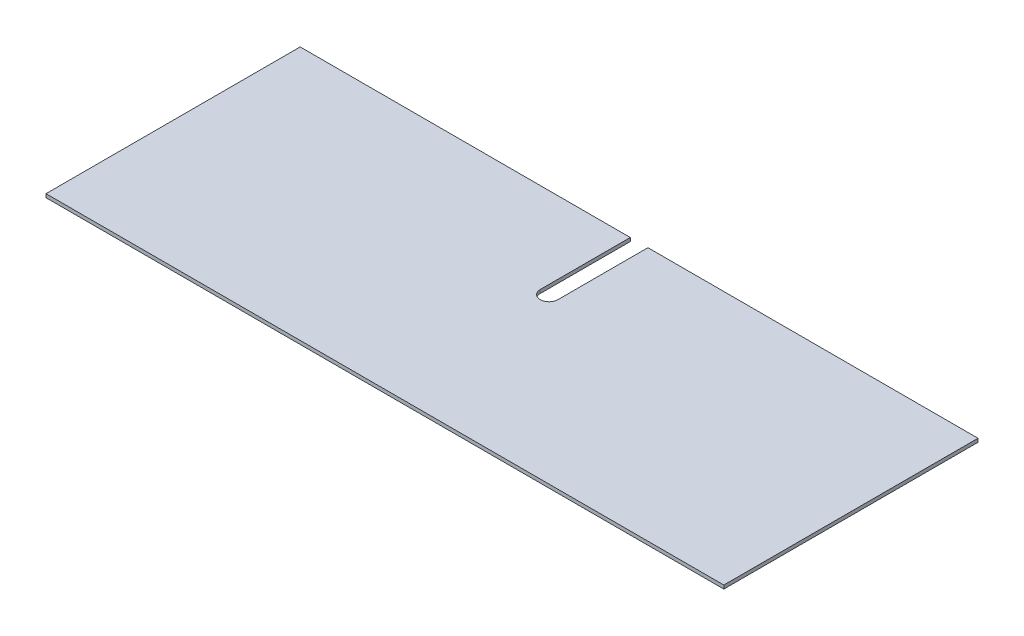
ISO-10303-21;
HEADER;
FILE_DESCRIPTION(('STEP AP214'),'2;1');
FILE_NAME('part.step','',(''),(''),'','','');
FILE_SCHEMA(('AUTOMOTIVE_DESIGN { 1 0 10303 214 1 1 1 1 }'));
ENDSEC;
DATA;
#1=APPLICATION_CONTEXT('core data for automotive mechanical design processes');
#2=APPLICATION_PROTOCOL_DEFINITION('international standard','automotive_design',2000,#1);
#3=PRODUCT_CONTEXT('',#1,'mechanical');
#4=PRODUCT('Part','Part','',(#3));
#5=PRODUCT_RELATED_PRODUCT_CATEGORY('part','',(#4));
#6=PRODUCT_DEFINITION_FORMATION('','',#4);
#7=PRODUCT_DEFINITION_CONTEXT('part definition',#1,'design');
#8=PRODUCT_DEFINITION('design','',#6,#7);
#9=PRODUCT_DEFINITION_SHAPE('','',#8);
#10=(LENGTH_UNIT() NAMED_UNIT(*) SI_UNIT(.MILLI.,.METRE.));
#11=(NAMED_UNIT(*) PLANE_ANGLE_UNIT() SI_UNIT($,.RADIAN.));
#12=(NAMED_UNIT(*) SI_UNIT($,.STERADIAN.) SOLID_ANGLE_UNIT());
#13=UNCERTAINTY_MEASURE_WITH_UNIT(LENGTH_MEASURE(1.E-05),#10,'distance_accuracy_value','');
#14=(GEOMETRIC_REPRESENTATION_CONTEXT(3) GLOBAL_UNCERTAINTY_ASSIGNED_CONTEXT((#13)) GLOBAL_UNIT_ASSIGNED_CONTEXT((#10,
#11,#12)) REPRESENTATION_CONTEXT('',''));
#15=CARTESIAN_POINT('',(0.,0.,0.));
#16=DIRECTION('',(0.,0.,1.));
#17=DIRECTION('',(1.,0.,0.));
#18=AXIS2_PLACEMENT_3D('',#15,#16,#17);
#19=CARTESIAN_POINT('',(0.,3.175,-228.6));
#20=DIRECTION('',(0.,0.,1.));
#21=DIRECTION('',(1.,0.,0.));
#22=AXIS2_PLACEMENT_3D('',#19,#20,#21);
#23=PLANE('',#22);
#24=DIRECTION('',(-1.,0.,0.));
#25=VECTOR('',#24,1.);
#26=CARTESIAN_POINT('',(0.,3.175,-228.6));
#27=LINE('',#26,#25);
#28=CARTESIAN_POINT('',(296.8625,3.175,-228.6));
#29=VERTEX_POINT('',#28);
#30=CARTESIAN_POINT('',(0.,3.175,-228.6));
#31=VERTEX_POINT('',#30);
#32=EDGE_CURVE('E56',#29,#31,#27,.T.);
#33=ORIENTED_EDGE('',*,*,#32,.F.);
#34=DIRECTION('',(0.,1.,0.));
#35=VECTOR('',#34,1.);
#36=CARTESIAN_POINT('',(296.8625,0.,-228.6));
#37=LINE('',#36,#35);
#38=CARTESIAN_POINT('',(296.8625,0.,-228.6));
#39=VERTEX_POINT('',#38);
#40=EDGE_CURVE('E132',#39,#29,#37,.T.);
#41=ORIENTED_EDGE('',*,*,#40,.F.);
#42=DIRECTION('',(-1.,0.,0.));
#43=VECTOR('',#42,1.);
#44=CARTESIAN_POINT('',(0.,0.,-228.6));
#45=LINE('',#44,#43);
#46=CARTESIAN_POINT('',(0.,0.,-228.6));
#47=VERTEX_POINT('',#46);
#48=EDGE_CURVE('E78',#39,#47,#45,.T.);
#49=ORIENTED_EDGE('',*,*,#48,.T.);
#50=DIRECTION('',(0.,-1.,0.));
#51=VECTOR('',#50,1.);
#52=CARTESIAN_POINT('',(0.,3.175,-228.6));
#53=LINE('',#52,#51);
#54=EDGE_CURVE('E148',#31,#47,#53,.T.);
#55=ORIENTED_EDGE('',*,*,#54,.F.);
#56=EDGE_LOOP('',(#33,#41,#49,#55));
#57=FACE_BOUND('',#56,.T.);
#58=ADVANCED_FACE('F32',(#57),#23,.F.);
#59=CARTESIAN_POINT('',(0.,3.175,0.));
#60=DIRECTION('',(1.,0.,0.));
#61=DIRECTION('',(0.,0.,-1.));
#62=AXIS2_PLACEMENT_3D('',#59,#60,#61);
#63=PLANE('',#62);
#64=DIRECTION('',(0.,0.,1.));
#65=VECTOR('',#64,1.);
#66=CARTESIAN_POINT('',(0.,0.,0.));
#67=LINE('',#66,#65);
#68=CARTESIAN_POINT('',(0.,0.,0.));
#69=VERTEX_POINT('',#68);
#70=EDGE_CURVE('E134',#47,#69,#67,.T.);
#71=ORIENTED_EDGE('',*,*,#70,.T.);
#72=DIRECTION('',(0.,-1.,0.));
#73=VECTOR('',#72,1.);
#74=CARTESIAN_POINT('',(0.,3.175,0.));
#75=LINE('',#74,#73);
#76=CARTESIAN_POINT('',(0.,3.175,0.));
#77=VERTEX_POINT('',#76);
#78=EDGE_CURVE('E11',#77,#69,#75,.T.);
#79=ORIENTED_EDGE('',*,*,#78,.F.);
#80=DIRECTION('',(0.,0.,1.));
#81=VECTOR('',#80,1.);
#82=CARTESIAN_POINT('',(0.,3.175,0.));
#83=LINE('',#82,#81);
#84=EDGE_CURVE('E139',#31,#77,#83,.T.);
#85=ORIENTED_EDGE('',*,*,#84,.F.);
#86=ORIENTED_EDGE('',*,*,#54,.T.);
#87=EDGE_LOOP('',(#71,#79,#85,#86));
#88=FACE_BOUND('',#87,.T.);
#89=ADVANCED_FACE('F34',(#88),#63,.F.);
#90=CARTESIAN_POINT('',(0.,3.175,0.));
#91=DIRECTION('',(0.,0.,-1.));
#92=DIRECTION('',(-1.,0.,0.));
#93=AXIS2_PLACEMENT_3D('',#90,#91,#92);
#94=PLANE('',#93);
#95=DIRECTION('',(1.,0.,0.));
#96=VECTOR('',#95,1.);
#97=CARTESIAN_POINT('',(0.,0.,0.));
#98=LINE('',#97,#96);
#99=CARTESIAN_POINT('',(609.6,0.,0.));
#100=VERTEX_POINT('',#99);
#101=EDGE_CURVE('E151',#69,#100,#98,.T.);
#102=ORIENTED_EDGE('',*,*,#101,.T.);
#103=DIRECTION('',(0.,-1.,0.));
#104=VECTOR('',#103,1.);
#105=CARTESIAN_POINT('',(609.6,3.175,0.));
#106=LINE('',#105,#104);
#107=CARTESIAN_POINT('',(609.6,3.175,0.));
#108=VERTEX_POINT('',#107);
#109=EDGE_CURVE('E40',#108,#100,#106,.T.);
#110=ORIENTED_EDGE('',*,*,#109,.F.);
#111=DIRECTION('',(1.,0.,0.));
#112=VECTOR('',#111,1.);
#113=CARTESIAN_POINT('',(0.,3.175,0.));
#114=LINE('',#113,#112);
#115=EDGE_CURVE('E85',#77,#108,#114,.T.);
#116=ORIENTED_EDGE('',*,*,#115,.F.);
#117=ORIENTED_EDGE('',*,*,#78,.T.);
#118=EDGE_LOOP('',(#102,#110,#116,#117));
#119=FACE_BOUND('',#118,.T.);
#120=ADVANCED_FACE('F175',(#119),#94,.F.);
#121=CARTESIAN_POINT('',(609.6,3.175,0.));
#122=DIRECTION('',(-1.,0.,0.));
#123=DIRECTION('',(0.,0.,1.));
#124=AXIS2_PLACEMENT_3D('',#121,#122,#123);
#125=PLANE('',#124);
#126=DIRECTION('',(0.,0.,-1.));
#127=VECTOR('',#126,1.);
#128=CARTESIAN_POINT('',(609.6,0.,0.));
#129=LINE('',#128,#127);
#130=CARTESIAN_POINT('',(609.6,0.,-228.6));
#131=VERTEX_POINT('',#130);
#132=EDGE_CURVE('E153',#100,#131,#129,.T.);
#133=ORIENTED_EDGE('',*,*,#132,.T.);
#134=DIRECTION('',(0.,-1.,0.));
#135=VECTOR('',#134,1.);
#136=CARTESIAN_POINT('',(609.6,3.175,-228.6));
#137=LINE('',#136,#135);
#138=CARTESIAN_POINT('',(609.6,3.175,-228.6));
#139=VERTEX_POINT('',#138);
#140=EDGE_CURVE('E158',#139,#131,#137,.T.);
#141=ORIENTED_EDGE('',*,*,#140,.F.);
#142=DIRECTION('',(0.,0.,-1.));
#143=VECTOR('',#142,1.);
#144=CARTESIAN_POINT('',(609.6,3.175,0.));
#145=LINE('',#144,#143);
#146=EDGE_CURVE('E143',#108,#139,#145,.T.);
#147=ORIENTED_EDGE('',*,*,#146,.F.);
#148=ORIENTED_EDGE('',*,*,#109,.T.);
#149=EDGE_LOOP('',(#133,#141,#147,#148));
#150=FACE_BOUND('',#149,.T.);
#151=ADVANCED_FACE('F164',(#150),#125,.F.);
#152=CARTESIAN_POINT('',(312.7375,0.,-228.6));
#153=VERTEX_POINT('',#152);
#154=EDGE_CURVE('E141',#131,#153,#45,.T.);
#155=ORIENTED_EDGE('',*,*,#154,.T.);
#156=DIRECTION('',(0.,1.,0.));
#157=VECTOR('',#156,1.);
#158=CARTESIAN_POINT('',(312.7375,0.,-228.6));
#159=LINE('',#158,#157);
#160=CARTESIAN_POINT('',(312.7375,3.175,-228.6));
#161=VERTEX_POINT('',#160);
#162=EDGE_CURVE('E135',#153,#161,#159,.T.);
#163=ORIENTED_EDGE('',*,*,#162,.T.);
#164=EDGE_CURVE('E145',#139,#161,#27,.T.);
#165=ORIENTED_EDGE('',*,*,#164,.F.);
#166=ORIENTED_EDGE('',*,*,#140,.T.);
#167=EDGE_LOOP('',(#155,#163,#165,#166));
#168=FACE_BOUND('',#167,.T.);
#169=ADVANCED_FACE('F168',(#168),#23,.F.);
#170=CARTESIAN_POINT('',(0.,3.175,0.));
#171=DIRECTION('',(0.,-1.,0.));
#172=DIRECTION('',(0.,0.,-1.));
#173=AXIS2_PLACEMENT_3D('',#170,#171,#172);
#174=PLANE('',#173);
#175=CARTESIAN_POINT('',(304.8,3.175,-147.6375));
#176=DIRECTION('',(0.,1.,0.));
#177=DIRECTION('',(0.,0.,1.));
#178=AXIS2_PLACEMENT_3D('',#175,#176,#177);
#179=CIRCLE('',#178,7.93750000000004);
#180=CARTESIAN_POINT('',(296.8625,3.175,-147.6375));
#181=VERTEX_POINT('',#180);
#182=CARTESIAN_POINT('',(312.7375,3.175,-147.6375));
#183=VERTEX_POINT('',#182);
#184=EDGE_CURVE('E126',#181,#183,#179,.T.);
#185=ORIENTED_EDGE('',*,*,#184,.F.);
#186=DIRECTION('',(0.,0.,1.));
#187=VECTOR('',#186,1.);
#188=CARTESIAN_POINT('',(296.8625,3.175,-228.6));
#189=LINE('',#188,#187);
#190=EDGE_CURVE('E111',#29,#181,#189,.T.);
#191=ORIENTED_EDGE('',*,*,#190,.F.);
#192=ORIENTED_EDGE('',*,*,#32,.T.);
#193=ORIENTED_EDGE('',*,*,#84,.T.);
#194=ORIENTED_EDGE('',*,*,#115,.T.);
#195=ORIENTED_EDGE('',*,*,#146,.T.);
#196=ORIENTED_EDGE('',*,*,#164,.T.);
#197=DIRECTION('',(0.,0.,-1.));
#198=VECTOR('',#197,1.);
#199=CARTESIAN_POINT('',(312.7375,3.175,-228.6));
#200=LINE('',#199,#198);
#201=EDGE_CURVE('E124',#183,#161,#200,.T.);
#202=ORIENTED_EDGE('',*,*,#201,.F.);
#203=EDGE_LOOP('',(#185,#191,#192,#193,#194,#195,#196,#202));
#204=FACE_BOUND('',#203,.T.);
#205=ADVANCED_FACE('F171',(#204),#174,.F.);
#206=CARTESIAN_POINT('',(0.,0.,0.));
#207=DIRECTION('',(0.,-1.,0.));
#208=DIRECTION('',(0.,0.,-1.));
#209=AXIS2_PLACEMENT_3D('',#206,#207,#208);
#210=PLANE('',#209);
#211=DIRECTION('',(0.,0.,1.));
#212=VECTOR('',#211,1.);
#213=CARTESIAN_POINT('',(296.8625,0.,-228.6));
#214=LINE('',#213,#212);
#215=CARTESIAN_POINT('',(296.8625,0.,-147.6375));
#216=VERTEX_POINT('',#215);
#217=EDGE_CURVE('E110',#39,#216,#214,.T.);
#218=ORIENTED_EDGE('',*,*,#217,.T.);
#219=CARTESIAN_POINT('',(304.8,0.,-147.6375));
#220=DIRECTION('',(0.,1.,0.));
#221=DIRECTION('',(0.,0.,1.));
#222=AXIS2_PLACEMENT_3D('',#219,#220,#221);
#223=CIRCLE('',#222,7.93750000000004);
#224=CARTESIAN_POINT('',(312.7375,0.,-147.6375));
#225=VERTEX_POINT('',#224);
#226=EDGE_CURVE('E118',#216,#225,#223,.T.);
#227=ORIENTED_EDGE('',*,*,#226,.T.);
#228=DIRECTION('',(0.,0.,-1.));
#229=VECTOR('',#228,1.);
#230=CARTESIAN_POINT('',(312.7375,0.,-228.6));
#231=LINE('',#230,#229);
#232=EDGE_CURVE('E47',#225,#153,#231,.T.);
#233=ORIENTED_EDGE('',*,*,#232,.T.);
#234=ORIENTED_EDGE('',*,*,#154,.F.);
#235=ORIENTED_EDGE('',*,*,#132,.F.);
#236=ORIENTED_EDGE('',*,*,#101,.F.);
#237=ORIENTED_EDGE('',*,*,#70,.F.);
#238=ORIENTED_EDGE('',*,*,#48,.F.);
#239=EDGE_LOOP('',(#218,#227,#233,#234,#235,#236,#237,#238));
#240=FACE_BOUND('',#239,.T.);
#241=ADVANCED_FACE('F122',(#240),#210,.T.);
#242=CARTESIAN_POINT('',(296.8625,0.,-228.6));
#243=DIRECTION('',(-1.,0.,0.));
#244=DIRECTION('',(0.,0.,1.));
#245=AXIS2_PLACEMENT_3D('',#242,#243,#244);
#246=PLANE('',#245);
#247=ORIENTED_EDGE('',*,*,#190,.T.);
#248=DIRECTION('',(0.,1.,0.));
#249=VECTOR('',#248,1.);
#250=CARTESIAN_POINT('',(296.8625,0.,-147.6375));
#251=LINE('',#250,#249);
#252=EDGE_CURVE('E106',#216,#181,#251,.T.);
#253=ORIENTED_EDGE('',*,*,#252,.F.);
#254=ORIENTED_EDGE('',*,*,#217,.F.);
#255=ORIENTED_EDGE('',*,*,#40,.T.);
#256=EDGE_LOOP('',(#247,#253,#254,#255));
#257=FACE_BOUND('',#256,.T.);
#258=ADVANCED_FACE('F108',(#257),#246,.F.);
#259=CARTESIAN_POINT('',(312.7375,0.,-228.6));
#260=DIRECTION('',(1.,0.,0.));
#261=DIRECTION('',(0.,0.,-1.));
#262=AXIS2_PLACEMENT_3D('',#259,#260,#261);
#263=PLANE('',#262);
#264=ORIENTED_EDGE('',*,*,#201,.T.);
#265=ORIENTED_EDGE('',*,*,#162,.F.);
#266=ORIENTED_EDGE('',*,*,#232,.F.);
#267=DIRECTION('',(0.,1.,0.));
#268=VECTOR('',#267,1.);
#269=CARTESIAN_POINT('',(312.7375,0.,-147.6375));
#270=LINE('',#269,#268);
#271=EDGE_CURVE('E115',#225,#183,#270,.T.);
#272=ORIENTED_EDGE('',*,*,#271,.T.);
#273=EDGE_LOOP('',(#264,#265,#266,#272));
#274=FACE_BOUND('',#273,.T.);
#275=ADVANCED_FACE('F198',(#274),#263,.F.);
#276=CARTESIAN_POINT('',(304.8,0.,-147.6375));
#277=DIRECTION('',(0.,1.,0.));
#278=DIRECTION('',(0.,0.,1.));
#279=AXIS2_PLACEMENT_3D('',#276,#277,#278);
#280=CYLINDRICAL_SURFACE('',#279,7.93750000000004);
#281=ORIENTED_EDGE('',*,*,#184,.T.);
#282=ORIENTED_EDGE('',*,*,#271,.F.);
#283=ORIENTED_EDGE('',*,*,#226,.F.);
#284=ORIENTED_EDGE('',*,*,#252,.T.);
#285=EDGE_LOOP('',(#281,#282,#283,#284));
#286=FACE_BOUND('',#285,.T.);
#287=ADVANCED_FACE('F119',(#286),#280,.F.);
#288=CLOSED_SHELL('',(#58,#89,#120,#151,#169,#205,#241,#258,#275,#287));
#289=MANIFOLD_SOLID_BREP('B2',#288);
#290=ADVANCED_BREP_SHAPE_REPRESENTATION('',(#18,#289),#14);
#291=SHAPE_DEFINITION_REPRESENTATION(#9,#290);
ENDSEC;
END-ISO-10303-21;
